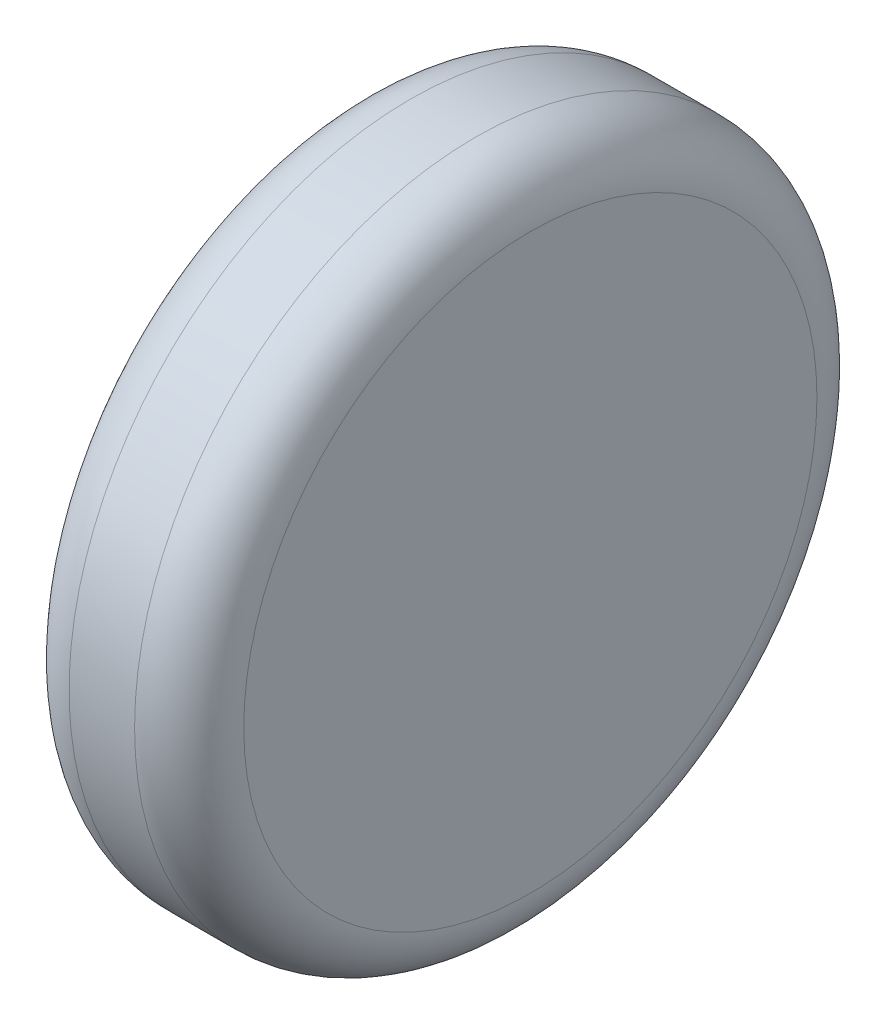
ISO-10303-21;
HEADER;
FILE_DESCRIPTION(('STEP AP214'),'2;1');
FILE_NAME('part.step','',(''),(''),'','','');
FILE_SCHEMA(('AUTOMOTIVE_DESIGN { 1 0 10303 214 1 1 1 1 }'));
ENDSEC;
DATA;
#1=APPLICATION_CONTEXT('core data for automotive mechanical design processes');
#2=APPLICATION_PROTOCOL_DEFINITION('international standard','automotive_design',2000,#1);
#3=PRODUCT_CONTEXT('',#1,'mechanical');
#4=PRODUCT('Part','Part','',(#3));
#5=PRODUCT_RELATED_PRODUCT_CATEGORY('part','',(#4));
#6=PRODUCT_DEFINITION_FORMATION('','',#4);
#7=PRODUCT_DEFINITION_CONTEXT('part definition',#1,'design');
#8=PRODUCT_DEFINITION('design','',#6,#7);
#9=PRODUCT_DEFINITION_SHAPE('','',#8);
#10=(LENGTH_UNIT() NAMED_UNIT(*) SI_UNIT(.MILLI.,.METRE.));
#11=(NAMED_UNIT(*) PLANE_ANGLE_UNIT() SI_UNIT($,.RADIAN.));
#12=(NAMED_UNIT(*) SI_UNIT($,.STERADIAN.) SOLID_ANGLE_UNIT());
#13=UNCERTAINTY_MEASURE_WITH_UNIT(LENGTH_MEASURE(1.E-05),#10,'distance_accuracy_value','');
#14=(GEOMETRIC_REPRESENTATION_CONTEXT(3) GLOBAL_UNCERTAINTY_ASSIGNED_CONTEXT((#13)) GLOBAL_UNIT_ASSIGNED_CONTEXT((#10,
#11,#12)) REPRESENTATION_CONTEXT('',''));
#15=CARTESIAN_POINT('',(0.,0.,0.));
#16=DIRECTION('',(0.,0.,1.));
#17=DIRECTION('',(1.,0.,0.));
#18=AXIS2_PLACEMENT_3D('',#15,#16,#17);
#19=CARTESIAN_POINT('',(0.404635714690617,-0.332340218761648,0.1012));
#20=DIRECTION('',(1.,0.,0.));
#21=DIRECTION('',(0.,1.,0.));
#22=AXIS2_PLACEMENT_3D('',#19,#20,#21);
#23=PLANE('',#22);
#24=CARTESIAN_POINT('',(0.404635714690617,-0.332340218761648,0.1012));
#25=DIRECTION('',(1.,0.,0.));
#26=DIRECTION('',(0.,0.,-1.));
#27=AXIS2_PLACEMENT_3D('',#24,#25,#26);
#28=CIRCLE('',#27,0.0262499999999999);
#29=CARTESIAN_POINT('',(0.404635714690617,-0.332340218761648,0.0749500000000001));
#30=VERTEX_POINT('',#29);
#31=CARTESIAN_POINT('',(0.404635714690617,-0.306090218761648,0.1012));
#32=VERTEX_POINT('',#31);
#33=EDGE_CURVE('E55',#30,#32,#28,.T.);
#34=ORIENTED_EDGE('',*,*,#33,.F.);
#35=CARTESIAN_POINT('',(0.404635714690617,-0.332340218761648,0.1012));
#36=DIRECTION('',(1.,0.,0.));
#37=DIRECTION('',(0.,0.,1.));
#38=AXIS2_PLACEMENT_3D('',#35,#36,#37);
#39=CIRCLE('',#38,0.02625);
#40=CARTESIAN_POINT('',(0.404635714690617,-0.332340218761648,0.12745));
#41=VERTEX_POINT('',#40);
#42=EDGE_CURVE('E49',#41,#30,#39,.T.);
#43=ORIENTED_EDGE('',*,*,#42,.F.);
#44=CARTESIAN_POINT('',(0.404635714690617,-0.332340218761648,0.1012));
#45=DIRECTION('',(1.,0.,0.));
#46=DIRECTION('',(0.,1.,0.));
#47=AXIS2_PLACEMENT_3D('',#44,#45,#46);
#48=CIRCLE('',#47,0.02625);
#49=EDGE_CURVE('E53',#32,#41,#48,.T.);
#50=ORIENTED_EDGE('',*,*,#49,.F.);
#51=EDGE_LOOP('',(#34,#43,#50));
#52=FACE_BOUND('',#51,.T.);
#53=ADVANCED_FACE('F17',(#52),#23,.F.);
#54=CARTESIAN_POINT('',(0.409635714690617,-0.332340218761648,0.1012));
#55=DIRECTION('',(1.,0.,0.));
#56=DIRECTION('',(0.,0.,1.));
#57=AXIS2_PLACEMENT_3D('',#54,#55,#56);
#58=TOROIDAL_SURFACE('',#57,0.02625,0.005);
#59=CARTESIAN_POINT('',(0.409635714690617,-0.332340218761648,0.1012));
#60=DIRECTION('',(1.,0.,0.));
#61=DIRECTION('',(0.,1.,0.));
#62=AXIS2_PLACEMENT_3D('',#59,#60,#61);
#63=CIRCLE('',#62,0.03125);
#64=CARTESIAN_POINT('',(0.409635714690617,-0.301090218761648,0.1012));
#65=VERTEX_POINT('',#64);
#66=EDGE_CURVE('E62',#65,#65,#63,.T.);
#67=ORIENTED_EDGE('',*,*,#66,.F.);
#68=EDGE_LOOP('',(#67));
#69=FACE_BOUND('',#68,.T.);
#70=ORIENTED_EDGE('',*,*,#33,.T.);
#71=ORIENTED_EDGE('',*,*,#49,.T.);
#72=ORIENTED_EDGE('',*,*,#42,.T.);
#73=EDGE_LOOP('',(#70,#71,#72));
#74=FACE_BOUND('',#73,.T.);
#75=ADVANCED_FACE('F60',(#69,#74),#58,.T.);
#76=CARTESIAN_POINT('',(0.420635714690617,-0.332340218761648,0.1012));
#77=DIRECTION('',(1.,0.,0.));
#78=DIRECTION('',(0.,1.,0.));
#79=AXIS2_PLACEMENT_3D('',#76,#77,#78);
#80=CYLINDRICAL_SURFACE('',#79,0.03125);
#81=CARTESIAN_POINT('',(0.415635714690617,-0.332340218761648,0.1012));
#82=DIRECTION('',(1.,0.,0.));
#83=DIRECTION('',(0.,0.,1.));
#84=AXIS2_PLACEMENT_3D('',#81,#82,#83);
#85=CIRCLE('',#84,0.03125);
#86=CARTESIAN_POINT('',(0.415635714690617,-0.332340218761648,0.13245));
#87=VERTEX_POINT('',#86);
#88=EDGE_CURVE('E86',#87,#87,#85,.T.);
#89=ORIENTED_EDGE('',*,*,#88,.F.);
#90=EDGE_LOOP('',(#89));
#91=FACE_BOUND('',#90,.T.);
#92=ORIENTED_EDGE('',*,*,#66,.T.);
#93=EDGE_LOOP('',(#92));
#94=FACE_BOUND('',#93,.T.);
#95=ADVANCED_FACE('F79',(#91,#94),#80,.T.);
#96=CARTESIAN_POINT('',(0.415635714690617,-0.332340218761648,0.1012));
#97=DIRECTION('',(1.,0.,0.));
#98=DIRECTION('',(0.,0.,1.));
#99=AXIS2_PLACEMENT_3D('',#96,#97,#98);
#100=TOROIDAL_SURFACE('',#99,0.02625,0.005);
#101=ORIENTED_EDGE('',*,*,#88,.T.);
#102=EDGE_LOOP('',(#101));
#103=FACE_BOUND('',#102,.T.);
#104=CARTESIAN_POINT('',(0.420635714690617,-0.332340218761648,0.1012));
#105=DIRECTION('',(-1.,0.,0.));
#106=DIRECTION('',(0.,0.,-1.));
#107=AXIS2_PLACEMENT_3D('',#104,#105,#106);
#108=CIRCLE('',#107,0.0262499999999999);
#109=CARTESIAN_POINT('',(0.420635714690617,-0.332340218761648,0.12745));
#110=VERTEX_POINT('',#109);
#111=CARTESIAN_POINT('',(0.420635714690617,-0.332340218761648,0.0749500000000001));
#112=VERTEX_POINT('',#111);
#113=EDGE_CURVE('E11',#110,#112,#108,.F.);
#114=ORIENTED_EDGE('',*,*,#113,.F.);
#115=CARTESIAN_POINT('',(0.420635714690617,-0.332340218761648,0.1012));
#116=DIRECTION('',(-1.,0.,0.));
#117=DIRECTION('',(0.,0.,1.));
#118=AXIS2_PLACEMENT_3D('',#115,#116,#117);
#119=CIRCLE('',#118,0.02625);
#120=CARTESIAN_POINT('',(0.420635714690617,-0.306090218761648,0.1012));
#121=VERTEX_POINT('',#120);
#122=EDGE_CURVE('E28',#121,#110,#119,.F.);
#123=ORIENTED_EDGE('',*,*,#122,.F.);
#124=CARTESIAN_POINT('',(0.420635714690617,-0.332340218761648,0.1012));
#125=DIRECTION('',(-1.,0.,0.));
#126=DIRECTION('',(0.,1.,0.));
#127=AXIS2_PLACEMENT_3D('',#124,#125,#126);
#128=CIRCLE('',#127,0.02625);
#129=EDGE_CURVE('E92',#112,#121,#128,.F.);
#130=ORIENTED_EDGE('',*,*,#129,.F.);
#131=EDGE_LOOP('',(#114,#123,#130));
#132=FACE_BOUND('',#131,.T.);
#133=ADVANCED_FACE('F117',(#103,#132),#100,.T.);
#134=CARTESIAN_POINT('',(0.420635714690617,-0.332340218761648,0.1012));
#135=DIRECTION('',(1.,0.,0.));
#136=DIRECTION('',(0.,1.,0.));
#137=AXIS2_PLACEMENT_3D('',#134,#135,#136);
#138=PLANE('',#137);
#139=ORIENTED_EDGE('',*,*,#122,.T.);
#140=ORIENTED_EDGE('',*,*,#113,.T.);
#141=ORIENTED_EDGE('',*,*,#129,.T.);
#142=EDGE_LOOP('',(#139,#140,#141));
#143=FACE_BOUND('',#142,.T.);
#144=ADVANCED_FACE('F99',(#143),#138,.T.);
#145=CLOSED_SHELL('',(#53,#75,#95,#133,#144));
#146=MANIFOLD_SOLID_BREP('B1',#145);
#147=ADVANCED_BREP_SHAPE_REPRESENTATION('',(#18,#146),#14);
#148=SHAPE_DEFINITION_REPRESENTATION(#9,#147);
ENDSEC;
END-ISO-10303-21;
